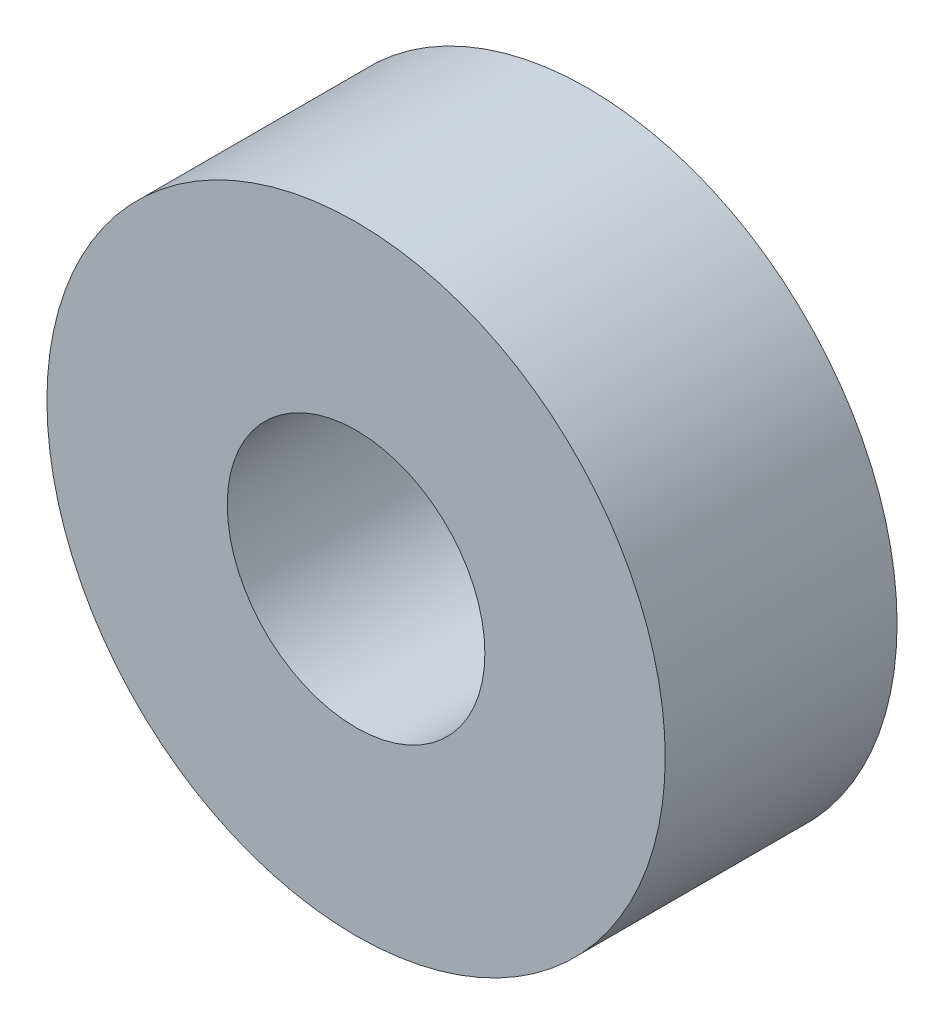
ISO-10303-21;
HEADER;
FILE_DESCRIPTION(('STEP AP214'),'2;1');
FILE_NAME('part.step','',(''),(''),'','','');
FILE_SCHEMA(('AUTOMOTIVE_DESIGN { 1 0 10303 214 1 1 1 1 }'));
ENDSEC;
DATA;
#1=APPLICATION_CONTEXT('core data for automotive mechanical design processes');
#2=APPLICATION_PROTOCOL_DEFINITION('international standard','automotive_design',2000,#1);
#3=PRODUCT_CONTEXT('',#1,'mechanical');
#4=PRODUCT('Part','Part','',(#3));
#5=PRODUCT_RELATED_PRODUCT_CATEGORY('part','',(#4));
#6=PRODUCT_DEFINITION_FORMATION('','',#4);
#7=PRODUCT_DEFINITION_CONTEXT('part definition',#1,'design');
#8=PRODUCT_DEFINITION('design','',#6,#7);
#9=PRODUCT_DEFINITION_SHAPE('','',#8);
#10=(LENGTH_UNIT() NAMED_UNIT(*) SI_UNIT(.MILLI.,.METRE.));
#11=(NAMED_UNIT(*) PLANE_ANGLE_UNIT() SI_UNIT($,.RADIAN.));
#12=(NAMED_UNIT(*) SI_UNIT($,.STERADIAN.) SOLID_ANGLE_UNIT());
#13=UNCERTAINTY_MEASURE_WITH_UNIT(LENGTH_MEASURE(1.E-05),#10,'distance_accuracy_value','');
#14=(GEOMETRIC_REPRESENTATION_CONTEXT(3) GLOBAL_UNCERTAINTY_ASSIGNED_CONTEXT((#13)) GLOBAL_UNIT_ASSIGNED_CONTEXT((#10,
#11,#12)) REPRESENTATION_CONTEXT('',''));
#15=CARTESIAN_POINT('',(0.,0.,0.));
#16=DIRECTION('',(0.,0.,1.));
#17=DIRECTION('',(1.,0.,0.));
#18=AXIS2_PLACEMENT_3D('',#15,#16,#17);
#19=CARTESIAN_POINT('',(0.,0.,4.5));
#20=DIRECTION('',(0.,0.,1.));
#21=DIRECTION('',(1.,0.,0.));
#22=AXIS2_PLACEMENT_3D('',#19,#20,#21);
#23=PLANE('',#22);
#24=CARTESIAN_POINT('',(0.,0.,4.5));
#25=DIRECTION('',(0.,0.,1.));
#26=DIRECTION('',(1.,0.,0.));
#27=AXIS2_PLACEMENT_3D('',#24,#25,#26);
#28=CIRCLE('',#27,6.);
#29=CARTESIAN_POINT('',(6.,0.,4.5));
#30=VERTEX_POINT('',#29);
#31=EDGE_CURVE('E10',#30,#30,#28,.T.);
#32=ORIENTED_EDGE('',*,*,#31,.T.);
#33=EDGE_LOOP('',(#32));
#34=FACE_BOUND('',#33,.T.);
#35=CARTESIAN_POINT('',(0.,0.,4.5));
#36=DIRECTION('',(0.,0.,1.));
#37=DIRECTION('',(1.,0.,0.));
#38=AXIS2_PLACEMENT_3D('',#35,#36,#37);
#39=CIRCLE('',#38,2.5);
#40=CARTESIAN_POINT('',(2.5,0.,4.5));
#41=VERTEX_POINT('',#40);
#42=EDGE_CURVE('E45',#41,#41,#39,.T.);
#43=ORIENTED_EDGE('',*,*,#42,.F.);
#44=EDGE_LOOP('',(#43));
#45=FACE_BOUND('',#44,.T.);
#46=ADVANCED_FACE('F34',(#34,#45),#23,.T.);
#47=CARTESIAN_POINT('',(0.,0.,0.));
#48=DIRECTION('',(0.,0.,1.));
#49=DIRECTION('',(1.,0.,0.));
#50=AXIS2_PLACEMENT_3D('',#47,#48,#49);
#51=PLANE('',#50);
#52=CARTESIAN_POINT('',(0.,0.,0.));
#53=DIRECTION('',(0.,0.,1.));
#54=DIRECTION('',(1.,0.,0.));
#55=AXIS2_PLACEMENT_3D('',#52,#53,#54);
#56=CIRCLE('',#55,6.);
#57=CARTESIAN_POINT('',(6.,0.,0.));
#58=VERTEX_POINT('',#57);
#59=EDGE_CURVE('E38',#58,#58,#56,.T.);
#60=ORIENTED_EDGE('',*,*,#59,.F.);
#61=EDGE_LOOP('',(#60));
#62=FACE_BOUND('',#61,.T.);
#63=CARTESIAN_POINT('',(0.,0.,0.));
#64=DIRECTION('',(0.,0.,1.));
#65=DIRECTION('',(1.,0.,0.));
#66=AXIS2_PLACEMENT_3D('',#63,#64,#65);
#67=CIRCLE('',#66,2.5);
#68=CARTESIAN_POINT('',(2.5,0.,0.));
#69=VERTEX_POINT('',#68);
#70=EDGE_CURVE('E47',#69,#69,#67,.T.);
#71=ORIENTED_EDGE('',*,*,#70,.T.);
#72=EDGE_LOOP('',(#71));
#73=FACE_BOUND('',#72,.T.);
#74=ADVANCED_FACE('F57',(#62,#73),#51,.F.);
#75=CARTESIAN_POINT('',(0.,0.,4.5));
#76=DIRECTION('',(0.,0.,-1.));
#77=DIRECTION('',(-1.,0.,0.));
#78=AXIS2_PLACEMENT_3D('',#75,#76,#77);
#79=CYLINDRICAL_SURFACE('',#78,6.);
#80=ORIENTED_EDGE('',*,*,#31,.F.);
#81=EDGE_LOOP('',(#80));
#82=FACE_BOUND('',#81,.T.);
#83=ORIENTED_EDGE('',*,*,#59,.T.);
#84=EDGE_LOOP('',(#83));
#85=FACE_BOUND('',#84,.T.);
#86=ADVANCED_FACE('F36',(#82,#85),#79,.T.);
#87=CARTESIAN_POINT('',(0.,0.,4.5));
#88=DIRECTION('',(0.,0.,-1.));
#89=DIRECTION('',(-1.,0.,0.));
#90=AXIS2_PLACEMENT_3D('',#87,#88,#89);
#91=CYLINDRICAL_SURFACE('',#90,2.5);
#92=ORIENTED_EDGE('',*,*,#42,.T.);
#93=EDGE_LOOP('',(#92));
#94=FACE_BOUND('',#93,.T.);
#95=ORIENTED_EDGE('',*,*,#70,.F.);
#96=EDGE_LOOP('',(#95));
#97=FACE_BOUND('',#96,.T.);
#98=ADVANCED_FACE('F53',(#94,#97),#91,.F.);
#99=CLOSED_SHELL('',(#46,#74,#86,#98));
#100=MANIFOLD_SOLID_BREP('B2',#99);
#101=ADVANCED_BREP_SHAPE_REPRESENTATION('',(#18,#100),#14);
#102=SHAPE_DEFINITION_REPRESENTATION(#9,#101);
ENDSEC;
END-ISO-10303-21;
